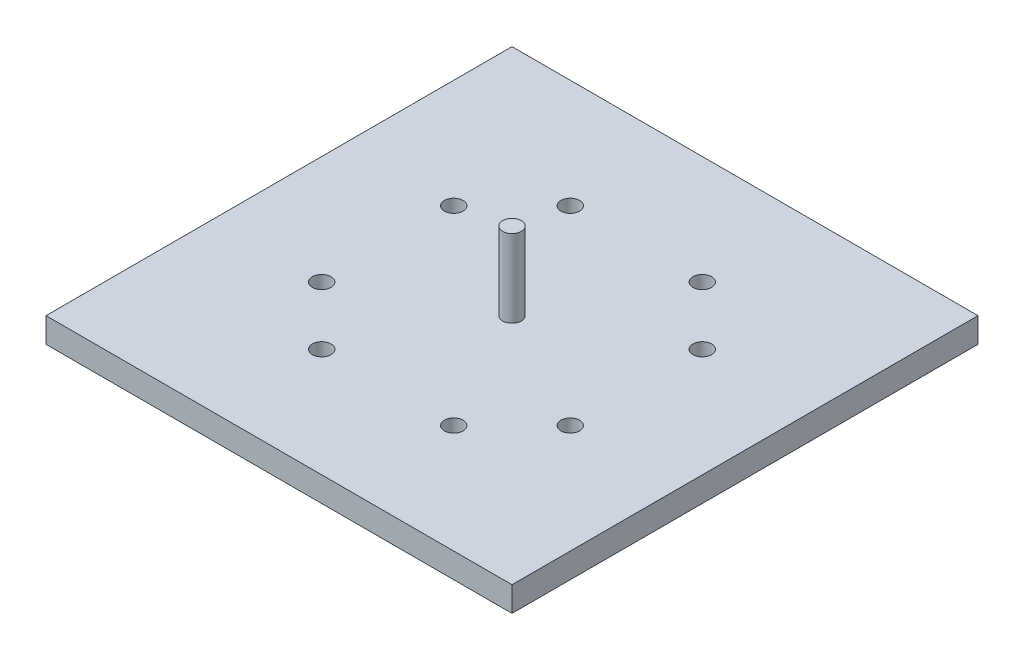
ISO-10303-21;
HEADER;
FILE_DESCRIPTION(('STEP AP214'),'2;1');
FILE_NAME('part.step','',(''),(''),'','','');
FILE_SCHEMA(('AUTOMOTIVE_DESIGN { 1 0 10303 214 1 1 1 1 }'));
ENDSEC;
DATA;
#1=APPLICATION_CONTEXT('core data for automotive mechanical design processes');
#2=APPLICATION_PROTOCOL_DEFINITION('international standard','automotive_design',2000,#1);
#3=PRODUCT_CONTEXT('',#1,'mechanical');
#4=PRODUCT('Part','Part','',(#3));
#5=PRODUCT_RELATED_PRODUCT_CATEGORY('part','',(#4));
#6=PRODUCT_DEFINITION_FORMATION('','',#4);
#7=PRODUCT_DEFINITION_CONTEXT('part definition',#1,'design');
#8=PRODUCT_DEFINITION('design','',#6,#7);
#9=PRODUCT_DEFINITION_SHAPE('','',#8);
#10=(LENGTH_UNIT() NAMED_UNIT(*) SI_UNIT(.MILLI.,.METRE.));
#11=(NAMED_UNIT(*) PLANE_ANGLE_UNIT() SI_UNIT($,.RADIAN.));
#12=(NAMED_UNIT(*) SI_UNIT($,.STERADIAN.) SOLID_ANGLE_UNIT());
#13=UNCERTAINTY_MEASURE_WITH_UNIT(LENGTH_MEASURE(1.E-05),#10,'distance_accuracy_value','');
#14=(GEOMETRIC_REPRESENTATION_CONTEXT(3) GLOBAL_UNCERTAINTY_ASSIGNED_CONTEXT((#13)) GLOBAL_UNIT_ASSIGNED_CONTEXT((#10,
#11,#12)) REPRESENTATION_CONTEXT('',''));
#15=CARTESIAN_POINT('',(0.,0.,0.));
#16=DIRECTION('',(0.,0.,1.));
#17=DIRECTION('',(1.,0.,0.));
#18=AXIS2_PLACEMENT_3D('',#15,#16,#17);
#19=CARTESIAN_POINT('',(0.,1.6,0.));
#20=DIRECTION('',(0.,0.,-1.));
#21=DIRECTION('',(-1.,0.,0.));
#22=AXIS2_PLACEMENT_3D('',#19,#20,#21);
#23=PLANE('',#22);
#24=DIRECTION('',(1.,0.,0.));
#25=VECTOR('',#24,1.);
#26=CARTESIAN_POINT('',(0.,0.,0.));
#27=LINE('',#26,#25);
#28=CARTESIAN_POINT('',(0.,0.,0.));
#29=VERTEX_POINT('',#28);
#30=CARTESIAN_POINT('',(30.,0.,0.));
#31=VERTEX_POINT('',#30);
#32=EDGE_CURVE('E113',#29,#31,#27,.T.);
#33=ORIENTED_EDGE('',*,*,#32,.T.);
#34=DIRECTION('',(0.,-1.,0.));
#35=VECTOR('',#34,1.);
#36=CARTESIAN_POINT('',(30.,1.6,0.));
#37=LINE('',#36,#35);
#38=CARTESIAN_POINT('',(30.,1.6,0.));
#39=VERTEX_POINT('',#38);
#40=EDGE_CURVE('E11',#39,#31,#37,.T.);
#41=ORIENTED_EDGE('',*,*,#40,.F.);
#42=DIRECTION('',(1.,0.,0.));
#43=VECTOR('',#42,1.);
#44=CARTESIAN_POINT('',(0.,1.6,0.));
#45=LINE('',#44,#43);
#46=CARTESIAN_POINT('',(0.,1.6,0.));
#47=VERTEX_POINT('',#46);
#48=EDGE_CURVE('E94',#47,#39,#45,.T.);
#49=ORIENTED_EDGE('',*,*,#48,.F.);
#50=DIRECTION('',(0.,-1.,0.));
#51=VECTOR('',#50,1.);
#52=CARTESIAN_POINT('',(0.,1.6,0.));
#53=LINE('',#52,#51);
#54=EDGE_CURVE('E61',#47,#29,#53,.T.);
#55=ORIENTED_EDGE('',*,*,#54,.T.);
#56=EDGE_LOOP('',(#33,#41,#49,#55));
#57=FACE_BOUND('',#56,.T.);
#58=ADVANCED_FACE('F44',(#57),#23,.F.);
#59=CARTESIAN_POINT('',(30.,1.6,0.));
#60=DIRECTION('',(-1.,0.,0.));
#61=DIRECTION('',(0.,0.,1.));
#62=AXIS2_PLACEMENT_3D('',#59,#60,#61);
#63=PLANE('',#62);
#64=DIRECTION('',(0.,0.,-1.));
#65=VECTOR('',#64,1.);
#66=CARTESIAN_POINT('',(30.,0.,0.));
#67=LINE('',#66,#65);
#68=CARTESIAN_POINT('',(30.,0.,-30.));
#69=VERTEX_POINT('',#68);
#70=EDGE_CURVE('E100',#31,#69,#67,.T.);
#71=ORIENTED_EDGE('',*,*,#70,.T.);
#72=DIRECTION('',(0.,-1.,0.));
#73=VECTOR('',#72,1.);
#74=CARTESIAN_POINT('',(30.,1.6,-30.));
#75=LINE('',#74,#73);
#76=CARTESIAN_POINT('',(30.,1.6,-30.));
#77=VERTEX_POINT('',#76);
#78=EDGE_CURVE('E53',#77,#69,#75,.T.);
#79=ORIENTED_EDGE('',*,*,#78,.F.);
#80=DIRECTION('',(0.,0.,-1.));
#81=VECTOR('',#80,1.);
#82=CARTESIAN_POINT('',(30.,1.6,0.));
#83=LINE('',#82,#81);
#84=EDGE_CURVE('E86',#39,#77,#83,.T.);
#85=ORIENTED_EDGE('',*,*,#84,.F.);
#86=ORIENTED_EDGE('',*,*,#40,.T.);
#87=EDGE_LOOP('',(#71,#79,#85,#86));
#88=FACE_BOUND('',#87,.T.);
#89=ADVANCED_FACE('F99',(#88),#63,.F.);
#90=CARTESIAN_POINT('',(0.,1.6,-30.));
#91=DIRECTION('',(0.,0.,-1.));
#92=DIRECTION('',(-1.,0.,0.));
#93=AXIS2_PLACEMENT_3D('',#90,#91,#92);
#94=PLANE('',#93);
#95=DIRECTION('',(1.,0.,0.));
#96=VECTOR('',#95,1.);
#97=CARTESIAN_POINT('',(0.,0.,-30.));
#98=LINE('',#97,#96);
#99=CARTESIAN_POINT('',(0.,0.,-30.));
#100=VERTEX_POINT('',#99);
#101=EDGE_CURVE('E119',#100,#69,#98,.T.);
#102=ORIENTED_EDGE('',*,*,#101,.F.);
#103=DIRECTION('',(0.,-1.,0.));
#104=VECTOR('',#103,1.);
#105=CARTESIAN_POINT('',(0.,1.6,-30.));
#106=LINE('',#105,#104);
#107=CARTESIAN_POINT('',(0.,1.6,-30.));
#108=VERTEX_POINT('',#107);
#109=EDGE_CURVE('E75',#108,#100,#106,.T.);
#110=ORIENTED_EDGE('',*,*,#109,.F.);
#111=DIRECTION('',(1.,0.,0.));
#112=VECTOR('',#111,1.);
#113=CARTESIAN_POINT('',(0.,1.6,-30.));
#114=LINE('',#113,#112);
#115=EDGE_CURVE('E93',#108,#77,#114,.T.);
#116=ORIENTED_EDGE('',*,*,#115,.T.);
#117=ORIENTED_EDGE('',*,*,#78,.T.);
#118=EDGE_LOOP('',(#102,#110,#116,#117));
#119=FACE_BOUND('',#118,.T.);
#120=ADVANCED_FACE('F104',(#119),#94,.T.);
#121=CARTESIAN_POINT('',(0.,1.6,0.));
#122=DIRECTION('',(-1.,0.,0.));
#123=DIRECTION('',(0.,0.,1.));
#124=AXIS2_PLACEMENT_3D('',#121,#122,#123);
#125=PLANE('',#124);
#126=DIRECTION('',(0.,0.,-1.));
#127=VECTOR('',#126,1.);
#128=CARTESIAN_POINT('',(0.,0.,0.));
#129=LINE('',#128,#127);
#130=EDGE_CURVE('E122',#29,#100,#129,.T.);
#131=ORIENTED_EDGE('',*,*,#130,.F.);
#132=ORIENTED_EDGE('',*,*,#54,.F.);
#133=DIRECTION('',(0.,0.,-1.));
#134=VECTOR('',#133,1.);
#135=CARTESIAN_POINT('',(0.,1.6,0.));
#136=LINE('',#135,#134);
#137=EDGE_CURVE('E106',#47,#108,#136,.T.);
#138=ORIENTED_EDGE('',*,*,#137,.T.);
#139=ORIENTED_EDGE('',*,*,#109,.T.);
#140=EDGE_LOOP('',(#131,#132,#138,#139));
#141=FACE_BOUND('',#140,.T.);
#142=ADVANCED_FACE('F215',(#141),#125,.T.);
#143=CARTESIAN_POINT('',(0.,1.6,0.));
#144=DIRECTION('',(0.,1.,0.));
#145=DIRECTION('',(0.,0.,1.));
#146=AXIS2_PLACEMENT_3D('',#143,#144,#145);
#147=PLANE('',#146);
#148=CARTESIAN_POINT('',(15.,1.6,-15.));
#149=DIRECTION('',(0.,1.,0.));
#150=DIRECTION('',(0.,0.,1.));
#151=AXIS2_PLACEMENT_3D('',#148,#149,#150);
#152=CIRCLE('',#151,0.6);
#153=CARTESIAN_POINT('',(15.,1.6,-14.4));
#154=VERTEX_POINT('',#153);
#155=EDGE_CURVE('E162',#154,#154,#152,.T.);
#156=ORIENTED_EDGE('',*,*,#155,.F.);
#157=EDGE_LOOP('',(#156));
#158=FACE_BOUND('',#157,.T.);
#159=CARTESIAN_POINT('',(23.,1.6,-10.75));
#160=DIRECTION('',(0.,1.,0.));
#161=DIRECTION('',(-1.,0.,0.));
#162=AXIS2_PLACEMENT_3D('',#159,#160,#161);
#163=CIRCLE('',#162,0.6);
#164=CARTESIAN_POINT('',(22.4,1.6,-10.75));
#165=VERTEX_POINT('',#164);
#166=EDGE_CURVE('E172',#165,#165,#163,.T.);
#167=ORIENTED_EDGE('',*,*,#166,.F.);
#168=EDGE_LOOP('',(#167));
#169=FACE_BOUND('',#168,.T.);
#170=CARTESIAN_POINT('',(6.99999999999999,1.6,-19.25));
#171=DIRECTION('',(0.,1.,0.));
#172=DIRECTION('',(-1.,0.,0.));
#173=AXIS2_PLACEMENT_3D('',#170,#171,#172);
#174=CIRCLE('',#173,0.6);
#175=CARTESIAN_POINT('',(6.39999999999999,1.6,-19.25));
#176=VERTEX_POINT('',#175);
#177=EDGE_CURVE('E159',#176,#176,#174,.T.);
#178=ORIENTED_EDGE('',*,*,#177,.F.);
#179=EDGE_LOOP('',(#178));
#180=FACE_BOUND('',#179,.T.);
#181=CARTESIAN_POINT('',(7.00000000000001,1.6,-10.75));
#182=DIRECTION('',(0.,1.,0.));
#183=DIRECTION('',(1.,0.,0.));
#184=AXIS2_PLACEMENT_3D('',#181,#182,#183);
#185=CIRCLE('',#184,0.6);
#186=CARTESIAN_POINT('',(7.60000000000001,1.6,-10.75));
#187=VERTEX_POINT('',#186);
#188=EDGE_CURVE('E160',#187,#187,#185,.T.);
#189=ORIENTED_EDGE('',*,*,#188,.F.);
#190=EDGE_LOOP('',(#189));
#191=FACE_BOUND('',#190,.T.);
#192=CARTESIAN_POINT('',(23.,1.6,-19.25));
#193=DIRECTION('',(0.,1.,0.));
#194=DIRECTION('',(1.,0.,0.));
#195=AXIS2_PLACEMENT_3D('',#192,#193,#194);
#196=CIRCLE('',#195,0.6);
#197=CARTESIAN_POINT('',(23.6,1.6,-19.25));
#198=VERTEX_POINT('',#197);
#199=EDGE_CURVE('E137',#198,#198,#196,.T.);
#200=ORIENTED_EDGE('',*,*,#199,.F.);
#201=EDGE_LOOP('',(#200));
#202=FACE_BOUND('',#201,.T.);
#203=CARTESIAN_POINT('',(10.75,1.6,-7.));
#204=DIRECTION('',(0.,1.,0.));
#205=DIRECTION('',(0.,0.,-1.));
#206=AXIS2_PLACEMENT_3D('',#203,#204,#205);
#207=CIRCLE('',#206,0.6);
#208=CARTESIAN_POINT('',(10.75,1.6,-7.6));
#209=VERTEX_POINT('',#208);
#210=EDGE_CURVE('E147',#209,#209,#207,.T.);
#211=ORIENTED_EDGE('',*,*,#210,.F.);
#212=EDGE_LOOP('',(#211));
#213=FACE_BOUND('',#212,.T.);
#214=CARTESIAN_POINT('',(19.25,1.6,-23.));
#215=DIRECTION('',(0.,1.,0.));
#216=DIRECTION('',(0.,0.,-1.));
#217=AXIS2_PLACEMENT_3D('',#214,#215,#216);
#218=CIRCLE('',#217,0.6);
#219=CARTESIAN_POINT('',(19.25,1.6,-23.6));
#220=VERTEX_POINT('',#219);
#221=EDGE_CURVE('E131',#220,#220,#218,.T.);
#222=ORIENTED_EDGE('',*,*,#221,.F.);
#223=EDGE_LOOP('',(#222));
#224=FACE_BOUND('',#223,.T.);
#225=CARTESIAN_POINT('',(10.75,1.6,-23.));
#226=DIRECTION('',(0.,1.,0.));
#227=DIRECTION('',(0.,0.,1.));
#228=AXIS2_PLACEMENT_3D('',#225,#226,#227);
#229=CIRCLE('',#228,0.6);
#230=CARTESIAN_POINT('',(10.75,1.6,-22.4));
#231=VERTEX_POINT('',#230);
#232=EDGE_CURVE('E143',#231,#231,#229,.T.);
#233=ORIENTED_EDGE('',*,*,#232,.F.);
#234=EDGE_LOOP('',(#233));
#235=FACE_BOUND('',#234,.T.);
#236=CARTESIAN_POINT('',(19.25,1.6,-7.));
#237=DIRECTION('',(0.,1.,0.));
#238=DIRECTION('',(0.,0.,1.));
#239=AXIS2_PLACEMENT_3D('',#236,#237,#238);
#240=CIRCLE('',#239,0.6);
#241=CARTESIAN_POINT('',(19.25,1.6,-6.4));
#242=VERTEX_POINT('',#241);
#243=EDGE_CURVE('E154',#242,#242,#240,.T.);
#244=ORIENTED_EDGE('',*,*,#243,.F.);
#245=EDGE_LOOP('',(#244));
#246=FACE_BOUND('',#245,.T.);
#247=ORIENTED_EDGE('',*,*,#48,.T.);
#248=ORIENTED_EDGE('',*,*,#84,.T.);
#249=ORIENTED_EDGE('',*,*,#115,.F.);
#250=ORIENTED_EDGE('',*,*,#137,.F.);
#251=EDGE_LOOP('',(#247,#248,#249,#250));
#252=FACE_BOUND('',#251,.T.);
#253=ADVANCED_FACE('F90',(#158,#169,#180,#191,#202,#213,#224,#235,#246,#252),#147,.T.);
#254=CARTESIAN_POINT('',(0.,0.,0.));
#255=DIRECTION('',(0.,1.,0.));
#256=DIRECTION('',(0.,0.,1.));
#257=AXIS2_PLACEMENT_3D('',#254,#255,#256);
#258=PLANE('',#257);
#259=CARTESIAN_POINT('',(23.,0.,-10.75));
#260=DIRECTION('',(0.,1.,0.));
#261=DIRECTION('',(-1.,0.,0.));
#262=AXIS2_PLACEMENT_3D('',#259,#260,#261);
#263=CIRCLE('',#262,0.6);
#264=CARTESIAN_POINT('',(22.4,0.,-10.75));
#265=VERTEX_POINT('',#264);
#266=EDGE_CURVE('E140',#265,#265,#263,.T.);
#267=ORIENTED_EDGE('',*,*,#266,.T.);
#268=EDGE_LOOP('',(#267));
#269=FACE_BOUND('',#268,.T.);
#270=CARTESIAN_POINT('',(6.99999999999999,0.,-19.25));
#271=DIRECTION('',(0.,1.,0.));
#272=DIRECTION('',(-1.,0.,0.));
#273=AXIS2_PLACEMENT_3D('',#270,#271,#272);
#274=CIRCLE('',#273,0.6);
#275=CARTESIAN_POINT('',(6.39999999999999,0.,-19.25));
#276=VERTEX_POINT('',#275);
#277=EDGE_CURVE('E176',#276,#276,#274,.T.);
#278=ORIENTED_EDGE('',*,*,#277,.T.);
#279=EDGE_LOOP('',(#278));
#280=FACE_BOUND('',#279,.T.);
#281=CARTESIAN_POINT('',(7.00000000000001,0.,-10.75));
#282=DIRECTION('',(0.,1.,0.));
#283=DIRECTION('',(1.,0.,0.));
#284=AXIS2_PLACEMENT_3D('',#281,#282,#283);
#285=CIRCLE('',#284,0.6);
#286=CARTESIAN_POINT('',(7.60000000000001,0.,-10.75));
#287=VERTEX_POINT('',#286);
#288=EDGE_CURVE('E156',#287,#287,#285,.T.);
#289=ORIENTED_EDGE('',*,*,#288,.T.);
#290=EDGE_LOOP('',(#289));
#291=FACE_BOUND('',#290,.T.);
#292=CARTESIAN_POINT('',(23.,0.,-19.25));
#293=DIRECTION('',(0.,1.,0.));
#294=DIRECTION('',(1.,0.,0.));
#295=AXIS2_PLACEMENT_3D('',#292,#293,#294);
#296=CIRCLE('',#295,0.6);
#297=CARTESIAN_POINT('',(23.6,0.,-19.25));
#298=VERTEX_POINT('',#297);
#299=EDGE_CURVE('E139',#298,#298,#296,.T.);
#300=ORIENTED_EDGE('',*,*,#299,.T.);
#301=EDGE_LOOP('',(#300));
#302=FACE_BOUND('',#301,.T.);
#303=CARTESIAN_POINT('',(10.75,0.,-7.));
#304=DIRECTION('',(0.,1.,0.));
#305=DIRECTION('',(0.,0.,-1.));
#306=AXIS2_PLACEMENT_3D('',#303,#304,#305);
#307=CIRCLE('',#306,0.6);
#308=CARTESIAN_POINT('',(10.75,0.,-7.6));
#309=VERTEX_POINT('',#308);
#310=EDGE_CURVE('E149',#309,#309,#307,.T.);
#311=ORIENTED_EDGE('',*,*,#310,.T.);
#312=EDGE_LOOP('',(#311));
#313=FACE_BOUND('',#312,.T.);
#314=CARTESIAN_POINT('',(19.25,0.,-23.));
#315=DIRECTION('',(0.,1.,0.));
#316=DIRECTION('',(0.,0.,-1.));
#317=AXIS2_PLACEMENT_3D('',#314,#315,#316);
#318=CIRCLE('',#317,0.6);
#319=CARTESIAN_POINT('',(19.25,0.,-23.6));
#320=VERTEX_POINT('',#319);
#321=EDGE_CURVE('E133',#320,#320,#318,.T.);
#322=ORIENTED_EDGE('',*,*,#321,.T.);
#323=EDGE_LOOP('',(#322));
#324=FACE_BOUND('',#323,.T.);
#325=CARTESIAN_POINT('',(10.75,0.,-23.));
#326=DIRECTION('',(0.,1.,0.));
#327=DIRECTION('',(0.,0.,1.));
#328=AXIS2_PLACEMENT_3D('',#325,#326,#327);
#329=CIRCLE('',#328,0.6);
#330=CARTESIAN_POINT('',(10.75,0.,-22.4));
#331=VERTEX_POINT('',#330);
#332=EDGE_CURVE('E134',#331,#331,#329,.T.);
#333=ORIENTED_EDGE('',*,*,#332,.T.);
#334=EDGE_LOOP('',(#333));
#335=FACE_BOUND('',#334,.T.);
#336=CARTESIAN_POINT('',(19.25,0.,-7.));
#337=DIRECTION('',(0.,1.,0.));
#338=DIRECTION('',(0.,0.,1.));
#339=AXIS2_PLACEMENT_3D('',#336,#337,#338);
#340=CIRCLE('',#339,0.6);
#341=CARTESIAN_POINT('',(19.25,0.,-6.4));
#342=VERTEX_POINT('',#341);
#343=EDGE_CURVE('E116',#342,#342,#340,.T.);
#344=ORIENTED_EDGE('',*,*,#343,.T.);
#345=EDGE_LOOP('',(#344));
#346=FACE_BOUND('',#345,.T.);
#347=ORIENTED_EDGE('',*,*,#32,.F.);
#348=ORIENTED_EDGE('',*,*,#130,.T.);
#349=ORIENTED_EDGE('',*,*,#101,.T.);
#350=ORIENTED_EDGE('',*,*,#70,.F.);
#351=EDGE_LOOP('',(#347,#348,#349,#350));
#352=FACE_BOUND('',#351,.T.);
#353=ADVANCED_FACE('F204',(#269,#280,#291,#302,#313,#324,#335,#346,#352),#258,.F.);
#354=CARTESIAN_POINT('',(19.25,0.,-7.));
#355=DIRECTION('',(0.,1.,0.));
#356=DIRECTION('',(0.,0.,1.));
#357=AXIS2_PLACEMENT_3D('',#354,#355,#356);
#358=CYLINDRICAL_SURFACE('',#357,0.6);
#359=ORIENTED_EDGE('',*,*,#343,.F.);
#360=EDGE_LOOP('',(#359));
#361=FACE_BOUND('',#360,.T.);
#362=ORIENTED_EDGE('',*,*,#243,.T.);
#363=EDGE_LOOP('',(#362));
#364=FACE_BOUND('',#363,.T.);
#365=ADVANCED_FACE('F207',(#361,#364),#358,.F.);
#366=CARTESIAN_POINT('',(10.75,0.,-23.));
#367=DIRECTION('',(0.,1.,0.));
#368=DIRECTION('',(0.,0.,1.));
#369=AXIS2_PLACEMENT_3D('',#366,#367,#368);
#370=CYLINDRICAL_SURFACE('',#369,0.6);
#371=ORIENTED_EDGE('',*,*,#332,.F.);
#372=EDGE_LOOP('',(#371));
#373=FACE_BOUND('',#372,.T.);
#374=ORIENTED_EDGE('',*,*,#232,.T.);
#375=EDGE_LOOP('',(#374));
#376=FACE_BOUND('',#375,.T.);
#377=ADVANCED_FACE('F210',(#373,#376),#370,.F.);
#378=CARTESIAN_POINT('',(19.25,0.,-23.));
#379=DIRECTION('',(0.,1.,0.));
#380=DIRECTION('',(0.,0.,1.));
#381=AXIS2_PLACEMENT_3D('',#378,#379,#380);
#382=CYLINDRICAL_SURFACE('',#381,0.6);
#383=ORIENTED_EDGE('',*,*,#321,.F.);
#384=EDGE_LOOP('',(#383));
#385=FACE_BOUND('',#384,.T.);
#386=ORIENTED_EDGE('',*,*,#221,.T.);
#387=EDGE_LOOP('',(#386));
#388=FACE_BOUND('',#387,.T.);
#389=ADVANCED_FACE('F264',(#385,#388),#382,.F.);
#390=CARTESIAN_POINT('',(10.75,0.,-7.));
#391=DIRECTION('',(0.,1.,0.));
#392=DIRECTION('',(0.,0.,1.));
#393=AXIS2_PLACEMENT_3D('',#390,#391,#392);
#394=CYLINDRICAL_SURFACE('',#393,0.6);
#395=ORIENTED_EDGE('',*,*,#310,.F.);
#396=EDGE_LOOP('',(#395));
#397=FACE_BOUND('',#396,.T.);
#398=ORIENTED_EDGE('',*,*,#210,.T.);
#399=EDGE_LOOP('',(#398));
#400=FACE_BOUND('',#399,.T.);
#401=ADVANCED_FACE('F273',(#397,#400),#394,.F.);
#402=CARTESIAN_POINT('',(23.,0.,-19.25));
#403=DIRECTION('',(0.,1.,0.));
#404=DIRECTION('',(0.,0.,1.));
#405=AXIS2_PLACEMENT_3D('',#402,#403,#404);
#406=CYLINDRICAL_SURFACE('',#405,0.6);
#407=ORIENTED_EDGE('',*,*,#299,.F.);
#408=EDGE_LOOP('',(#407));
#409=FACE_BOUND('',#408,.T.);
#410=ORIENTED_EDGE('',*,*,#199,.T.);
#411=EDGE_LOOP('',(#410));
#412=FACE_BOUND('',#411,.T.);
#413=ADVANCED_FACE('F281',(#409,#412),#406,.F.);
#414=CARTESIAN_POINT('',(7.00000000000001,0.,-10.75));
#415=DIRECTION('',(0.,1.,0.));
#416=DIRECTION('',(0.,0.,1.));
#417=AXIS2_PLACEMENT_3D('',#414,#415,#416);
#418=CYLINDRICAL_SURFACE('',#417,0.6);
#419=ORIENTED_EDGE('',*,*,#288,.F.);
#420=EDGE_LOOP('',(#419));
#421=FACE_BOUND('',#420,.T.);
#422=ORIENTED_EDGE('',*,*,#188,.T.);
#423=EDGE_LOOP('',(#422));
#424=FACE_BOUND('',#423,.T.);
#425=ADVANCED_FACE('F289',(#421,#424),#418,.F.);
#426=CARTESIAN_POINT('',(6.99999999999999,0.,-19.25));
#427=DIRECTION('',(0.,1.,0.));
#428=DIRECTION('',(0.,0.,1.));
#429=AXIS2_PLACEMENT_3D('',#426,#427,#428);
#430=CYLINDRICAL_SURFACE('',#429,0.6);
#431=ORIENTED_EDGE('',*,*,#277,.F.);
#432=EDGE_LOOP('',(#431));
#433=FACE_BOUND('',#432,.T.);
#434=ORIENTED_EDGE('',*,*,#177,.T.);
#435=EDGE_LOOP('',(#434));
#436=FACE_BOUND('',#435,.T.);
#437=ADVANCED_FACE('F298',(#433,#436),#430,.F.);
#438=CARTESIAN_POINT('',(23.,0.,-10.75));
#439=DIRECTION('',(0.,1.,0.));
#440=DIRECTION('',(0.,0.,1.));
#441=AXIS2_PLACEMENT_3D('',#438,#439,#440);
#442=CYLINDRICAL_SURFACE('',#441,0.6);
#443=ORIENTED_EDGE('',*,*,#266,.F.);
#444=EDGE_LOOP('',(#443));
#445=FACE_BOUND('',#444,.T.);
#446=ORIENTED_EDGE('',*,*,#166,.T.);
#447=EDGE_LOOP('',(#446));
#448=FACE_BOUND('',#447,.T.);
#449=ADVANCED_FACE('F307',(#445,#448),#442,.F.);
#450=CARTESIAN_POINT('',(15.,6.6,-15.));
#451=DIRECTION('',(0.,-1.,0.));
#452=DIRECTION('',(0.,0.,-1.));
#453=AXIS2_PLACEMENT_3D('',#450,#451,#452);
#454=CYLINDRICAL_SURFACE('',#453,0.6);
#455=CARTESIAN_POINT('',(15.,6.6,-15.));
#456=DIRECTION('',(0.,1.,0.));
#457=DIRECTION('',(0.,0.,1.));
#458=AXIS2_PLACEMENT_3D('',#455,#456,#457);
#459=CIRCLE('',#458,0.6);
#460=CARTESIAN_POINT('',(15.,6.6,-14.4));
#461=VERTEX_POINT('',#460);
#462=EDGE_CURVE('E164',#461,#461,#459,.T.);
#463=ORIENTED_EDGE('',*,*,#462,.F.);
#464=EDGE_LOOP('',(#463));
#465=FACE_BOUND('',#464,.T.);
#466=ORIENTED_EDGE('',*,*,#155,.T.);
#467=EDGE_LOOP('',(#466));
#468=FACE_BOUND('',#467,.T.);
#469=ADVANCED_FACE('F315',(#465,#468),#454,.T.);
#470=CARTESIAN_POINT('',(15.,6.6,-15.));
#471=DIRECTION('',(0.,1.,0.));
#472=DIRECTION('',(0.,0.,1.));
#473=AXIS2_PLACEMENT_3D('',#470,#471,#472);
#474=PLANE('',#473);
#475=ORIENTED_EDGE('',*,*,#462,.T.);
#476=EDGE_LOOP('',(#475));
#477=FACE_BOUND('',#476,.T.);
#478=ADVANCED_FACE('F324',(#477),#474,.T.);
#479=CLOSED_SHELL('',(#58,#89,#120,#142,#253,#353,#365,#377,#389,#401,#413,#425,#437,#449,#469,#478));
#480=MANIFOLD_SOLID_BREP('B2',#479);
#481=ADVANCED_BREP_SHAPE_REPRESENTATION('',(#18,#480),#14);
#482=SHAPE_DEFINITION_REPRESENTATION(#9,#481);
ENDSEC;
END-ISO-10303-21;
